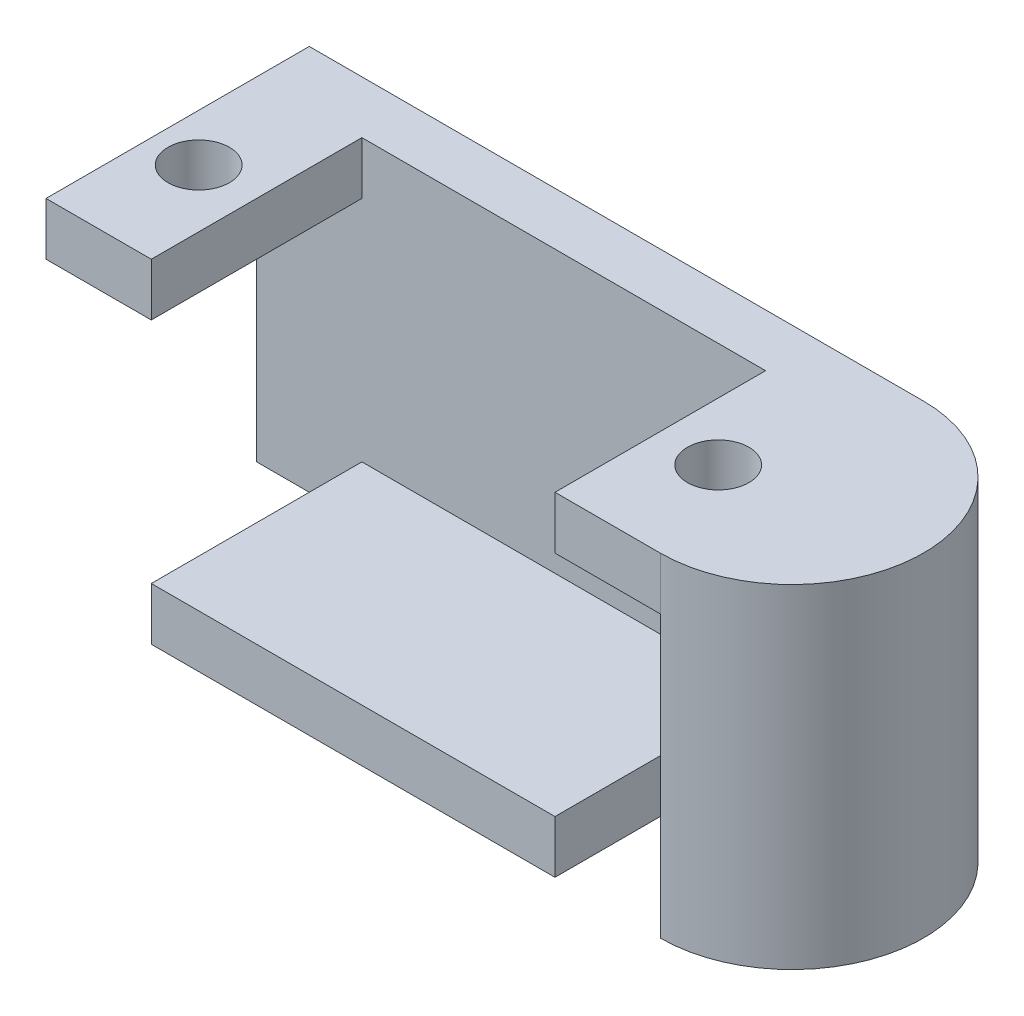
ISO-10303-21;
HEADER;
FILE_DESCRIPTION(('STEP AP214'),'2;1');
FILE_NAME('part.step','',(''),(''),'','','');
FILE_SCHEMA(('AUTOMOTIVE_DESIGN { 1 0 10303 214 1 1 1 1 }'));
ENDSEC;
DATA;
#1=APPLICATION_CONTEXT('core data for automotive mechanical design processes');
#2=APPLICATION_PROTOCOL_DEFINITION('international standard','automotive_design',2000,#1);
#3=PRODUCT_CONTEXT('',#1,'mechanical');
#4=PRODUCT('Part','Part','',(#3));
#5=PRODUCT_RELATED_PRODUCT_CATEGORY('part','',(#4));
#6=PRODUCT_DEFINITION_FORMATION('','',#4);
#7=PRODUCT_DEFINITION_CONTEXT('part definition',#1,'design');
#8=PRODUCT_DEFINITION('design','',#6,#7);
#9=PRODUCT_DEFINITION_SHAPE('','',#8);
#10=(LENGTH_UNIT() NAMED_UNIT(*) SI_UNIT(.MILLI.,.METRE.));
#11=(NAMED_UNIT(*) PLANE_ANGLE_UNIT() SI_UNIT($,.RADIAN.));
#12=(NAMED_UNIT(*) SI_UNIT($,.STERADIAN.) SOLID_ANGLE_UNIT());
#13=UNCERTAINTY_MEASURE_WITH_UNIT(LENGTH_MEASURE(1.E-05),#10,'distance_accuracy_value','');
#14=(GEOMETRIC_REPRESENTATION_CONTEXT(3) GLOBAL_UNCERTAINTY_ASSIGNED_CONTEXT((#13)) GLOBAL_UNIT_ASSIGNED_CONTEXT((#10,
#11,#12)) REPRESENTATION_CONTEXT('',''));
#15=CARTESIAN_POINT('',(0.,0.,0.));
#16=DIRECTION('',(0.,0.,1.));
#17=DIRECTION('',(1.,0.,0.));
#18=AXIS2_PLACEMENT_3D('',#15,#16,#17);
#19=CARTESIAN_POINT('',(35.,0.,-7.5));
#20=DIRECTION('',(0.,1.,0.));
#21=DIRECTION('',(0.,0.,1.));
#22=AXIS2_PLACEMENT_3D('',#19,#20,#21);
#23=PLANE('',#22);
#24=CARTESIAN_POINT('',(35.,0.,-7.5));
#25=DIRECTION('',(0.,1.,0.));
#26=DIRECTION('',(0.,0.,1.));
#27=AXIS2_PLACEMENT_3D('',#24,#25,#26);
#28=CIRCLE('',#27,7.5);
#29=CARTESIAN_POINT('',(35.,0.,0.));
#30=VERTEX_POINT('',#29);
#31=CARTESIAN_POINT('',(35.,0.,-15.));
#32=VERTEX_POINT('',#31);
#33=EDGE_CURVE('E252',#30,#32,#28,.T.);
#34=ORIENTED_EDGE('',*,*,#33,.F.);
#35=DIRECTION('',(0.,0.,1.));
#36=VECTOR('',#35,1.);
#37=CARTESIAN_POINT('',(35.,0.,-12.));
#38=LINE('',#37,#36);
#39=CARTESIAN_POINT('',(35.,0.,-12.));
#40=VERTEX_POINT('',#39);
#41=EDGE_CURVE('E227',#40,#30,#38,.T.);
#42=ORIENTED_EDGE('',*,*,#41,.F.);
#43=DIRECTION('',(1.,0.,0.));
#44=VECTOR('',#43,1.);
#45=CARTESIAN_POINT('',(35.,0.,-12.));
#46=LINE('',#45,#44);
#47=CARTESIAN_POINT('',(29.,0.,-12.));
#48=VERTEX_POINT('',#47);
#49=EDGE_CURVE('E189',#48,#40,#46,.T.);
#50=ORIENTED_EDGE('',*,*,#49,.F.);
#51=DIRECTION('',(0.,0.,1.));
#52=VECTOR('',#51,1.);
#53=CARTESIAN_POINT('',(29.,0.,-12.));
#54=LINE('',#53,#52);
#55=CARTESIAN_POINT('',(29.,0.,0.));
#56=VERTEX_POINT('',#55);
#57=EDGE_CURVE('E229',#48,#56,#54,.T.);
#58=ORIENTED_EDGE('',*,*,#57,.T.);
#59=DIRECTION('',(1.,0.,0.));
#60=VECTOR('',#59,1.);
#61=CARTESIAN_POINT('',(0.,0.,0.));
#62=LINE('',#61,#60);
#63=CARTESIAN_POINT('',(6.,0.,0.));
#64=VERTEX_POINT('',#63);
#65=EDGE_CURVE('E249',#64,#56,#62,.T.);
#66=ORIENTED_EDGE('',*,*,#65,.F.);
#67=DIRECTION('',(0.,0.,1.));
#68=VECTOR('',#67,1.);
#69=CARTESIAN_POINT('',(6.,0.,-12.));
#70=LINE('',#69,#68);
#71=CARTESIAN_POINT('',(6.,0.,-12.));
#72=VERTEX_POINT('',#71);
#73=EDGE_CURVE('E236',#72,#64,#70,.T.);
#74=ORIENTED_EDGE('',*,*,#73,.F.);
#75=DIRECTION('',(1.,0.,0.));
#76=VECTOR('',#75,1.);
#77=CARTESIAN_POINT('',(6.,0.,-12.));
#78=LINE('',#77,#76);
#79=CARTESIAN_POINT('',(0.,0.,-12.));
#80=VERTEX_POINT('',#79);
#81=EDGE_CURVE('E178',#80,#72,#78,.T.);
#82=ORIENTED_EDGE('',*,*,#81,.F.);
#83=DIRECTION('',(0.,0.,1.));
#84=VECTOR('',#83,1.);
#85=CARTESIAN_POINT('',(0.,0.,0.));
#86=LINE('',#85,#84);
#87=CARTESIAN_POINT('',(0.,0.,-15.));
#88=VERTEX_POINT('',#87);
#89=EDGE_CURVE('E219',#88,#80,#86,.T.);
#90=ORIENTED_EDGE('',*,*,#89,.F.);
#91=DIRECTION('',(-1.,0.,0.));
#92=VECTOR('',#91,1.);
#93=CARTESIAN_POINT('',(0.,0.,-15.));
#94=LINE('',#93,#92);
#95=EDGE_CURVE('E72',#32,#88,#94,.T.);
#96=ORIENTED_EDGE('',*,*,#95,.F.);
#97=EDGE_LOOP('',(#34,#42,#50,#58,#66,#74,#82,#90,#96));
#98=FACE_BOUND('',#97,.T.);
#99=CARTESIAN_POINT('',(12.,0.,-6.));
#100=DIRECTION('',(0.,1.,0.));
#101=DIRECTION('',(0.,0.,1.));
#102=AXIS2_PLACEMENT_3D('',#99,#100,#101);
#103=CIRCLE('',#102,1.25);
#104=CARTESIAN_POINT('',(12.,0.,-4.75));
#105=VERTEX_POINT('',#104);
#106=EDGE_CURVE('E11',#105,#105,#103,.F.);
#107=ORIENTED_EDGE('',*,*,#106,.F.);
#108=EDGE_LOOP('',(#107));
#109=FACE_BOUND('',#108,.T.);
#110=ADVANCED_FACE('F33',(#98,#109),#23,.F.);
#111=CARTESIAN_POINT('',(0.,19.,0.));
#112=DIRECTION('',(0.,0.,-1.));
#113=DIRECTION('',(-1.,0.,0.));
#114=AXIS2_PLACEMENT_3D('',#111,#112,#113);
#115=PLANE('',#114);
#116=DIRECTION('',(1.,0.,0.));
#117=VECTOR('',#116,1.);
#118=CARTESIAN_POINT('',(0.,19.,0.));
#119=LINE('',#118,#117);
#120=CARTESIAN_POINT('',(29.,19.,0.));
#121=VERTEX_POINT('',#120);
#122=CARTESIAN_POINT('',(35.,19.,0.));
#123=VERTEX_POINT('',#122);
#124=EDGE_CURVE('E241',#121,#123,#119,.T.);
#125=ORIENTED_EDGE('',*,*,#124,.F.);
#126=DIRECTION('',(0.,1.,0.));
#127=VECTOR('',#126,1.);
#128=CARTESIAN_POINT('',(29.,19.,0.));
#129=LINE('',#128,#127);
#130=CARTESIAN_POINT('',(29.,16.,0.));
#131=VERTEX_POINT('',#130);
#132=EDGE_CURVE('E169',#131,#121,#129,.T.);
#133=ORIENTED_EDGE('',*,*,#132,.F.);
#134=DIRECTION('',(-1.,0.,0.));
#135=VECTOR('',#134,1.);
#136=CARTESIAN_POINT('',(29.,16.,0.));
#137=LINE('',#136,#135);
#138=CARTESIAN_POINT('',(35.,16.,0.));
#139=VERTEX_POINT('',#138);
#140=EDGE_CURVE('E171',#139,#131,#137,.T.);
#141=ORIENTED_EDGE('',*,*,#140,.F.);
#142=DIRECTION('',(0.,-1.,0.));
#143=VECTOR('',#142,1.);
#144=CARTESIAN_POINT('',(35.,19.,0.));
#145=LINE('',#144,#143);
#146=EDGE_CURVE('E258',#123,#139,#145,.T.);
#147=ORIENTED_EDGE('',*,*,#146,.F.);
#148=EDGE_LOOP('',(#125,#133,#141,#147));
#149=FACE_BOUND('',#148,.T.);
#150=ADVANCED_FACE('F287',(#149),#115,.F.);
#151=ORIENTED_EDGE('',*,*,#65,.T.);
#152=DIRECTION('',(0.,-1.,0.));
#153=VECTOR('',#152,1.);
#154=CARTESIAN_POINT('',(29.,0.,0.));
#155=LINE('',#154,#153);
#156=CARTESIAN_POINT('',(29.,3.,0.));
#157=VERTEX_POINT('',#156);
#158=EDGE_CURVE('E210',#157,#56,#155,.T.);
#159=ORIENTED_EDGE('',*,*,#158,.F.);
#160=DIRECTION('',(1.,0.,0.));
#161=VECTOR('',#160,1.);
#162=CARTESIAN_POINT('',(6.,3.,0.));
#163=LINE('',#162,#161);
#164=CARTESIAN_POINT('',(6.,3.,0.));
#165=VERTEX_POINT('',#164);
#166=EDGE_CURVE('E207',#165,#157,#163,.T.);
#167=ORIENTED_EDGE('',*,*,#166,.F.);
#168=DIRECTION('',(0.,1.,0.));
#169=VECTOR('',#168,1.);
#170=CARTESIAN_POINT('',(6.,3.,0.));
#171=LINE('',#170,#169);
#172=EDGE_CURVE('E204',#64,#165,#171,.T.);
#173=ORIENTED_EDGE('',*,*,#172,.F.);
#174=EDGE_LOOP('',(#151,#159,#167,#173));
#175=FACE_BOUND('',#174,.T.);
#176=ADVANCED_FACE('F295',(#175),#115,.F.);
#177=CARTESIAN_POINT('',(0.,19.,0.));
#178=DIRECTION('',(1.,0.,0.));
#179=DIRECTION('',(0.,0.,-1.));
#180=AXIS2_PLACEMENT_3D('',#177,#178,#179);
#181=PLANE('',#180);
#182=DIRECTION('',(0.,-1.,0.));
#183=VECTOR('',#182,1.);
#184=CARTESIAN_POINT('',(0.,3.82476488460703,-12.));
#185=LINE('',#184,#183);
#186=CARTESIAN_POINT('',(0.,16.,-12.));
#187=VERTEX_POINT('',#186);
#188=EDGE_CURVE('E48',#187,#80,#185,.T.);
#189=ORIENTED_EDGE('',*,*,#188,.F.);
#190=DIRECTION('',(0.,0.,1.));
#191=VECTOR('',#190,1.);
#192=CARTESIAN_POINT('',(0.,16.,-12.));
#193=LINE('',#192,#191);
#194=CARTESIAN_POINT('',(0.,16.,0.));
#195=VERTEX_POINT('',#194);
#196=EDGE_CURVE('E158',#187,#195,#193,.T.);
#197=ORIENTED_EDGE('',*,*,#196,.T.);
#198=DIRECTION('',(0.,-1.,0.));
#199=VECTOR('',#198,1.);
#200=CARTESIAN_POINT('',(0.,19.,0.));
#201=LINE('',#200,#199);
#202=CARTESIAN_POINT('',(0.,19.,0.));
#203=VERTEX_POINT('',#202);
#204=EDGE_CURVE('E41',#203,#195,#201,.T.);
#205=ORIENTED_EDGE('',*,*,#204,.F.);
#206=DIRECTION('',(0.,0.,1.));
#207=VECTOR('',#206,1.);
#208=CARTESIAN_POINT('',(0.,19.,0.));
#209=LINE('',#208,#207);
#210=CARTESIAN_POINT('',(0.,19.,-15.));
#211=VERTEX_POINT('',#210);
#212=EDGE_CURVE('E239',#211,#203,#209,.T.);
#213=ORIENTED_EDGE('',*,*,#212,.F.);
#214=DIRECTION('',(0.,-1.,0.));
#215=VECTOR('',#214,1.);
#216=CARTESIAN_POINT('',(0.,19.,-15.));
#217=LINE('',#216,#215);
#218=EDGE_CURVE('E246',#211,#88,#217,.T.);
#219=ORIENTED_EDGE('',*,*,#218,.T.);
#220=ORIENTED_EDGE('',*,*,#89,.T.);
#221=EDGE_LOOP('',(#189,#197,#205,#213,#219,#220));
#222=FACE_BOUND('',#221,.T.);
#223=ADVANCED_FACE('F35',(#222),#181,.F.);
#224=DIRECTION('',(-1.,0.,0.));
#225=VECTOR('',#224,1.);
#226=CARTESIAN_POINT('',(6.,16.,0.));
#227=LINE('',#226,#225);
#228=CARTESIAN_POINT('',(6.,16.,0.));
#229=VERTEX_POINT('',#228);
#230=EDGE_CURVE('E201',#229,#195,#227,.T.);
#231=ORIENTED_EDGE('',*,*,#230,.F.);
#232=DIRECTION('',(0.,-1.,0.));
#233=VECTOR('',#232,1.);
#234=CARTESIAN_POINT('',(6.,19.,0.));
#235=LINE('',#234,#233);
#236=CARTESIAN_POINT('',(6.,19.,0.));
#237=VERTEX_POINT('',#236);
#238=EDGE_CURVE('E155',#237,#229,#235,.T.);
#239=ORIENTED_EDGE('',*,*,#238,.F.);
#240=EDGE_CURVE('E80',#203,#237,#119,.T.);
#241=ORIENTED_EDGE('',*,*,#240,.F.);
#242=ORIENTED_EDGE('',*,*,#204,.T.);
#243=EDGE_LOOP('',(#231,#239,#241,#242));
#244=FACE_BOUND('',#243,.T.);
#245=ADVANCED_FACE('F297',(#244),#115,.F.);
#246=CARTESIAN_POINT('',(35.,19.,-7.5));
#247=DIRECTION('',(0.,-1.,0.));
#248=DIRECTION('',(0.,0.,-1.));
#249=AXIS2_PLACEMENT_3D('',#246,#247,#248);
#250=CYLINDRICAL_SURFACE('',#249,7.5);
#251=ORIENTED_EDGE('',*,*,#33,.T.);
#252=DIRECTION('',(0.,-1.,0.));
#253=VECTOR('',#252,1.);
#254=CARTESIAN_POINT('',(35.,19.,-15.));
#255=LINE('',#254,#253);
#256=CARTESIAN_POINT('',(35.,19.,-15.));
#257=VERTEX_POINT('',#256);
#258=EDGE_CURVE('E256',#257,#32,#255,.T.);
#259=ORIENTED_EDGE('',*,*,#258,.F.);
#260=CARTESIAN_POINT('',(35.,19.,-7.5));
#261=DIRECTION('',(0.,1.,0.));
#262=DIRECTION('',(0.,0.,1.));
#263=AXIS2_PLACEMENT_3D('',#260,#261,#262);
#264=CIRCLE('',#263,7.5);
#265=EDGE_CURVE('E243',#123,#257,#264,.T.);
#266=ORIENTED_EDGE('',*,*,#265,.F.);
#267=ORIENTED_EDGE('',*,*,#146,.T.);
#268=DIRECTION('',(0.,1.,0.));
#269=VECTOR('',#268,1.);
#270=CARTESIAN_POINT('',(35.,16.,0.));
#271=LINE('',#270,#269);
#272=EDGE_CURVE('E212',#30,#139,#271,.T.);
#273=ORIENTED_EDGE('',*,*,#272,.F.);
#274=EDGE_LOOP('',(#251,#259,#266,#267,#273));
#275=FACE_BOUND('',#274,.T.);
#276=ADVANCED_FACE('F306',(#275),#250,.T.);
#277=CARTESIAN_POINT('',(0.,19.,-15.));
#278=DIRECTION('',(0.,0.,1.));
#279=DIRECTION('',(1.,0.,0.));
#280=AXIS2_PLACEMENT_3D('',#277,#278,#279);
#281=PLANE('',#280);
#282=ORIENTED_EDGE('',*,*,#95,.T.);
#283=ORIENTED_EDGE('',*,*,#218,.F.);
#284=DIRECTION('',(-1.,0.,0.));
#285=VECTOR('',#284,1.);
#286=CARTESIAN_POINT('',(0.,19.,-15.));
#287=LINE('',#286,#285);
#288=EDGE_CURVE('E57',#257,#211,#287,.T.);
#289=ORIENTED_EDGE('',*,*,#288,.F.);
#290=ORIENTED_EDGE('',*,*,#258,.T.);
#291=EDGE_LOOP('',(#282,#283,#289,#290));
#292=FACE_BOUND('',#291,.T.);
#293=ADVANCED_FACE('F303',(#292),#281,.F.);
#294=CARTESIAN_POINT('',(35.,19.,-7.5));
#295=DIRECTION('',(0.,1.,0.));
#296=DIRECTION('',(0.,0.,1.));
#297=AXIS2_PLACEMENT_3D('',#294,#295,#296);
#298=PLANE('',#297);
#299=CARTESIAN_POINT('',(32.3,19.,-6.));
#300=DIRECTION('',(0.,1.,0.));
#301=DIRECTION('',(0.,0.,1.));
#302=AXIS2_PLACEMENT_3D('',#299,#300,#301);
#303=CIRCLE('',#302,1.75);
#304=CARTESIAN_POINT('',(32.3,19.,-4.25));
#305=VERTEX_POINT('',#304);
#306=EDGE_CURVE('E265',#305,#305,#303,.T.);
#307=ORIENTED_EDGE('',*,*,#306,.F.);
#308=EDGE_LOOP('',(#307));
#309=FACE_BOUND('',#308,.T.);
#310=CARTESIAN_POINT('',(2.7,19.,-6.));
#311=DIRECTION('',(0.,1.,0.));
#312=DIRECTION('',(0.,0.,1.));
#313=AXIS2_PLACEMENT_3D('',#310,#311,#312);
#314=CIRCLE('',#313,1.75);
#315=CARTESIAN_POINT('',(2.7,19.,-4.25));
#316=VERTEX_POINT('',#315);
#317=EDGE_CURVE('E174',#316,#316,#314,.T.);
#318=ORIENTED_EDGE('',*,*,#317,.F.);
#319=EDGE_LOOP('',(#318));
#320=FACE_BOUND('',#319,.T.);
#321=DIRECTION('',(0.,0.,1.));
#322=VECTOR('',#321,1.);
#323=CARTESIAN_POINT('',(6.,19.,-12.));
#324=LINE('',#323,#322);
#325=CARTESIAN_POINT('',(6.,19.,-12.));
#326=VERTEX_POINT('',#325);
#327=EDGE_CURVE('E217',#326,#237,#324,.T.);
#328=ORIENTED_EDGE('',*,*,#327,.F.);
#329=DIRECTION('',(-1.,0.,0.));
#330=VECTOR('',#329,1.);
#331=CARTESIAN_POINT('',(6.,19.,-12.));
#332=LINE('',#331,#330);
#333=CARTESIAN_POINT('',(29.,19.,-12.));
#334=VERTEX_POINT('',#333);
#335=EDGE_CURVE('E159',#334,#326,#332,.T.);
#336=ORIENTED_EDGE('',*,*,#335,.F.);
#337=DIRECTION('',(0.,0.,1.));
#338=VECTOR('',#337,1.);
#339=CARTESIAN_POINT('',(29.,19.,-12.));
#340=LINE('',#339,#338);
#341=EDGE_CURVE('E220',#334,#121,#340,.T.);
#342=ORIENTED_EDGE('',*,*,#341,.T.);
#343=ORIENTED_EDGE('',*,*,#124,.T.);
#344=ORIENTED_EDGE('',*,*,#265,.T.);
#345=ORIENTED_EDGE('',*,*,#288,.T.);
#346=ORIENTED_EDGE('',*,*,#212,.T.);
#347=ORIENTED_EDGE('',*,*,#240,.T.);
#348=EDGE_LOOP('',(#328,#336,#342,#343,#344,#345,#346,#347));
#349=FACE_BOUND('',#348,.T.);
#350=ADVANCED_FACE('F301',(#309,#320,#349),#298,.T.);
#351=CARTESIAN_POINT('',(6.,19.,-12.));
#352=DIRECTION('',(-1.,0.,0.));
#353=DIRECTION('',(0.,0.,1.));
#354=AXIS2_PLACEMENT_3D('',#351,#352,#353);
#355=PLANE('',#354);
#356=ORIENTED_EDGE('',*,*,#238,.T.);
#357=DIRECTION('',(0.,0.,1.));
#358=VECTOR('',#357,1.);
#359=CARTESIAN_POINT('',(6.,16.,-12.));
#360=LINE('',#359,#358);
#361=CARTESIAN_POINT('',(6.,16.,-12.));
#362=VERTEX_POINT('',#361);
#363=EDGE_CURVE('E149',#362,#229,#360,.T.);
#364=ORIENTED_EDGE('',*,*,#363,.F.);
#365=DIRECTION('',(0.,-1.,0.));
#366=VECTOR('',#365,1.);
#367=CARTESIAN_POINT('',(6.,19.,-12.));
#368=LINE('',#367,#366);
#369=EDGE_CURVE('E153',#326,#362,#368,.T.);
#370=ORIENTED_EDGE('',*,*,#369,.F.);
#371=ORIENTED_EDGE('',*,*,#327,.T.);
#372=EDGE_LOOP('',(#356,#364,#370,#371));
#373=FACE_BOUND('',#372,.T.);
#374=ADVANCED_FACE('F151',(#373),#355,.F.);
#375=CARTESIAN_POINT('',(29.,19.,-12.));
#376=DIRECTION('',(1.,0.,0.));
#377=DIRECTION('',(0.,0.,-1.));
#378=AXIS2_PLACEMENT_3D('',#375,#376,#377);
#379=PLANE('',#378);
#380=ORIENTED_EDGE('',*,*,#132,.T.);
#381=ORIENTED_EDGE('',*,*,#341,.F.);
#382=DIRECTION('',(0.,1.,0.));
#383=VECTOR('',#382,1.);
#384=CARTESIAN_POINT('',(29.,19.,-12.));
#385=LINE('',#384,#383);
#386=CARTESIAN_POINT('',(29.,16.,-12.));
#387=VERTEX_POINT('',#386);
#388=EDGE_CURVE('E197',#387,#334,#385,.T.);
#389=ORIENTED_EDGE('',*,*,#388,.F.);
#390=DIRECTION('',(0.,0.,1.));
#391=VECTOR('',#390,1.);
#392=CARTESIAN_POINT('',(29.,16.,-12.));
#393=LINE('',#392,#391);
#394=EDGE_CURVE('E223',#387,#131,#393,.T.);
#395=ORIENTED_EDGE('',*,*,#394,.T.);
#396=EDGE_LOOP('',(#380,#381,#389,#395));
#397=FACE_BOUND('',#396,.T.);
#398=ADVANCED_FACE('F351',(#397),#379,.F.);
#399=CARTESIAN_POINT('',(29.,16.,-12.));
#400=DIRECTION('',(0.,1.,0.));
#401=DIRECTION('',(0.,0.,1.));
#402=AXIS2_PLACEMENT_3D('',#399,#400,#401);
#403=PLANE('',#402);
#404=CARTESIAN_POINT('',(32.3,16.,-6.));
#405=DIRECTION('',(0.,1.,0.));
#406=DIRECTION('',(0.,0.,1.));
#407=AXIS2_PLACEMENT_3D('',#404,#405,#406);
#408=CIRCLE('',#407,1.75);
#409=CARTESIAN_POINT('',(32.3,16.,-4.25));
#410=VERTEX_POINT('',#409);
#411=EDGE_CURVE('E263',#410,#410,#408,.T.);
#412=ORIENTED_EDGE('',*,*,#411,.T.);
#413=EDGE_LOOP('',(#412));
#414=FACE_BOUND('',#413,.T.);
#415=ORIENTED_EDGE('',*,*,#140,.T.);
#416=ORIENTED_EDGE('',*,*,#394,.F.);
#417=DIRECTION('',(-1.,0.,0.));
#418=VECTOR('',#417,1.);
#419=CARTESIAN_POINT('',(29.,16.,-12.));
#420=LINE('',#419,#418);
#421=CARTESIAN_POINT('',(35.,16.,-12.));
#422=VERTEX_POINT('',#421);
#423=EDGE_CURVE('E194',#422,#387,#420,.T.);
#424=ORIENTED_EDGE('',*,*,#423,.F.);
#425=DIRECTION('',(0.,0.,1.));
#426=VECTOR('',#425,1.);
#427=CARTESIAN_POINT('',(35.,16.,-12.));
#428=LINE('',#427,#426);
#429=EDGE_CURVE('E225',#422,#139,#428,.T.);
#430=ORIENTED_EDGE('',*,*,#429,.T.);
#431=EDGE_LOOP('',(#415,#416,#424,#430));
#432=FACE_BOUND('',#431,.T.);
#433=ADVANCED_FACE('F348',(#414,#432),#403,.F.);
#434=CARTESIAN_POINT('',(35.,16.,-12.));
#435=DIRECTION('',(1.,0.,0.));
#436=DIRECTION('',(0.,0.,-1.));
#437=AXIS2_PLACEMENT_3D('',#434,#435,#436);
#438=PLANE('',#437);
#439=ORIENTED_EDGE('',*,*,#272,.T.);
#440=ORIENTED_EDGE('',*,*,#429,.F.);
#441=DIRECTION('',(0.,1.,0.));
#442=VECTOR('',#441,1.);
#443=CARTESIAN_POINT('',(35.,3.14477901188326,-12.));
#444=LINE('',#443,#442);
#445=EDGE_CURVE('E192',#40,#422,#444,.T.);
#446=ORIENTED_EDGE('',*,*,#445,.F.);
#447=ORIENTED_EDGE('',*,*,#41,.T.);
#448=EDGE_LOOP('',(#439,#440,#446,#447));
#449=FACE_BOUND('',#448,.T.);
#450=ADVANCED_FACE('F343',(#449),#438,.F.);
#451=CARTESIAN_POINT('',(29.,0.,-12.));
#452=DIRECTION('',(-1.,0.,0.));
#453=DIRECTION('',(0.,0.,1.));
#454=AXIS2_PLACEMENT_3D('',#451,#452,#453);
#455=PLANE('',#454);
#456=ORIENTED_EDGE('',*,*,#158,.T.);
#457=ORIENTED_EDGE('',*,*,#57,.F.);
#458=DIRECTION('',(0.,-1.,0.));
#459=VECTOR('',#458,1.);
#460=CARTESIAN_POINT('',(29.,0.,-12.));
#461=LINE('',#460,#459);
#462=CARTESIAN_POINT('',(29.,3.,-12.));
#463=VERTEX_POINT('',#462);
#464=EDGE_CURVE('E186',#463,#48,#461,.T.);
#465=ORIENTED_EDGE('',*,*,#464,.F.);
#466=DIRECTION('',(0.,0.,1.));
#467=VECTOR('',#466,1.);
#468=CARTESIAN_POINT('',(29.,3.,-12.));
#469=LINE('',#468,#467);
#470=EDGE_CURVE('E232',#463,#157,#469,.T.);
#471=ORIENTED_EDGE('',*,*,#470,.T.);
#472=EDGE_LOOP('',(#456,#457,#465,#471));
#473=FACE_BOUND('',#472,.T.);
#474=ADVANCED_FACE('F327',(#473),#455,.F.);
#475=CARTESIAN_POINT('',(6.,3.,-12.));
#476=DIRECTION('',(0.,-1.,0.));
#477=DIRECTION('',(0.,0.,-1.));
#478=AXIS2_PLACEMENT_3D('',#475,#476,#477);
#479=PLANE('',#478);
#480=ORIENTED_EDGE('',*,*,#166,.T.);
#481=ORIENTED_EDGE('',*,*,#470,.F.);
#482=DIRECTION('',(1.,0.,0.));
#483=VECTOR('',#482,1.);
#484=CARTESIAN_POINT('',(6.,3.,-12.));
#485=LINE('',#484,#483);
#486=CARTESIAN_POINT('',(6.,3.,-12.));
#487=VERTEX_POINT('',#486);
#488=EDGE_CURVE('E183',#487,#463,#485,.T.);
#489=ORIENTED_EDGE('',*,*,#488,.F.);
#490=DIRECTION('',(0.,0.,1.));
#491=VECTOR('',#490,1.);
#492=CARTESIAN_POINT('',(6.,3.,-12.));
#493=LINE('',#492,#491);
#494=EDGE_CURVE('E234',#487,#165,#493,.T.);
#495=ORIENTED_EDGE('',*,*,#494,.T.);
#496=EDGE_LOOP('',(#480,#481,#489,#495));
#497=FACE_BOUND('',#496,.T.);
#498=ADVANCED_FACE('F330',(#497),#479,.F.);
#499=CARTESIAN_POINT('',(6.,3.,-12.));
#500=DIRECTION('',(1.,0.,0.));
#501=DIRECTION('',(0.,0.,-1.));
#502=AXIS2_PLACEMENT_3D('',#499,#500,#501);
#503=PLANE('',#502);
#504=ORIENTED_EDGE('',*,*,#172,.T.);
#505=ORIENTED_EDGE('',*,*,#494,.F.);
#506=DIRECTION('',(0.,1.,0.));
#507=VECTOR('',#506,1.);
#508=CARTESIAN_POINT('',(6.,3.,-12.));
#509=LINE('',#508,#507);
#510=EDGE_CURVE('E180',#72,#487,#509,.T.);
#511=ORIENTED_EDGE('',*,*,#510,.F.);
#512=ORIENTED_EDGE('',*,*,#73,.T.);
#513=EDGE_LOOP('',(#504,#505,#511,#512));
#514=FACE_BOUND('',#513,.T.);
#515=ADVANCED_FACE('F332',(#514),#503,.F.);
#516=CARTESIAN_POINT('',(6.,16.,-12.));
#517=DIRECTION('',(0.,1.,0.));
#518=DIRECTION('',(0.,0.,1.));
#519=AXIS2_PLACEMENT_3D('',#516,#517,#518);
#520=PLANE('',#519);
#521=CARTESIAN_POINT('',(2.7,16.,-6.));
#522=DIRECTION('',(0.,1.,0.));
#523=DIRECTION('',(0.,0.,1.));
#524=AXIS2_PLACEMENT_3D('',#521,#522,#523);
#525=CIRCLE('',#524,1.75);
#526=CARTESIAN_POINT('',(2.7,16.,-4.25));
#527=VERTEX_POINT('',#526);
#528=EDGE_CURVE('E202',#527,#527,#525,.T.);
#529=ORIENTED_EDGE('',*,*,#528,.T.);
#530=EDGE_LOOP('',(#529));
#531=FACE_BOUND('',#530,.T.);
#532=ORIENTED_EDGE('',*,*,#230,.T.);
#533=ORIENTED_EDGE('',*,*,#196,.F.);
#534=DIRECTION('',(-1.,0.,0.));
#535=VECTOR('',#534,1.);
#536=CARTESIAN_POINT('',(6.,16.,-12.));
#537=LINE('',#536,#535);
#538=EDGE_CURVE('E161',#362,#187,#537,.T.);
#539=ORIENTED_EDGE('',*,*,#538,.F.);
#540=ORIENTED_EDGE('',*,*,#363,.T.);
#541=EDGE_LOOP('',(#532,#533,#539,#540));
#542=FACE_BOUND('',#541,.T.);
#543=ADVANCED_FACE('F162',(#531,#542),#520,.F.);
#544=CARTESIAN_POINT('',(0.,0.,-12.));
#545=DIRECTION('',(0.,0.,-1.));
#546=DIRECTION('',(-1.,0.,0.));
#547=AXIS2_PLACEMENT_3D('',#544,#545,#546);
#548=PLANE('',#547);
#549=ORIENTED_EDGE('',*,*,#369,.T.);
#550=ORIENTED_EDGE('',*,*,#538,.T.);
#551=ORIENTED_EDGE('',*,*,#188,.T.);
#552=ORIENTED_EDGE('',*,*,#81,.T.);
#553=ORIENTED_EDGE('',*,*,#510,.T.);
#554=ORIENTED_EDGE('',*,*,#488,.T.);
#555=ORIENTED_EDGE('',*,*,#464,.T.);
#556=ORIENTED_EDGE('',*,*,#49,.T.);
#557=ORIENTED_EDGE('',*,*,#445,.T.);
#558=ORIENTED_EDGE('',*,*,#423,.T.);
#559=ORIENTED_EDGE('',*,*,#388,.T.);
#560=ORIENTED_EDGE('',*,*,#335,.T.);
#561=EDGE_LOOP('',(#549,#550,#551,#552,#553,#554,#555,#556,#557,#558,#559,#560));
#562=FACE_BOUND('',#561,.T.);
#563=ADVANCED_FACE('F165',(#562),#548,.F.);
#564=CARTESIAN_POINT('',(2.7,7.,-6.));
#565=DIRECTION('',(0.,1.,0.));
#566=DIRECTION('',(0.,0.,1.));
#567=AXIS2_PLACEMENT_3D('',#564,#565,#566);
#568=CYLINDRICAL_SURFACE('',#567,1.75);
#569=ORIENTED_EDGE('',*,*,#317,.T.);
#570=EDGE_LOOP('',(#569));
#571=FACE_BOUND('',#570,.T.);
#572=ORIENTED_EDGE('',*,*,#528,.F.);
#573=EDGE_LOOP('',(#572));
#574=FACE_BOUND('',#573,.T.);
#575=ADVANCED_FACE('F375',(#571,#574),#568,.F.);
#576=CARTESIAN_POINT('',(32.3,7.,-6.));
#577=DIRECTION('',(0.,1.,0.));
#578=DIRECTION('',(0.,0.,1.));
#579=AXIS2_PLACEMENT_3D('',#576,#577,#578);
#580=CYLINDRICAL_SURFACE('',#579,1.75);
#581=ORIENTED_EDGE('',*,*,#306,.T.);
#582=EDGE_LOOP('',(#581));
#583=FACE_BOUND('',#582,.T.);
#584=ORIENTED_EDGE('',*,*,#411,.F.);
#585=EDGE_LOOP('',(#584));
#586=FACE_BOUND('',#585,.T.);
#587=ADVANCED_FACE('F282',(#583,#586),#580,.F.);
#588=CARTESIAN_POINT('',(12.,-3.,-6.));
#589=DIRECTION('',(0.,1.,0.));
#590=DIRECTION('',(0.,0.,1.));
#591=AXIS2_PLACEMENT_3D('',#588,#589,#590);
#592=CYLINDRICAL_SURFACE('',#591,1.25);
#593=CARTESIAN_POINT('',(12.,-3.,-6.));
#594=DIRECTION('',(0.,-1.,0.));
#595=DIRECTION('',(0.,0.,-1.));
#596=AXIS2_PLACEMENT_3D('',#593,#594,#595);
#597=CIRCLE('',#596,1.25);
#598=CARTESIAN_POINT('',(12.,-3.,-7.25));
#599=VERTEX_POINT('',#598);
#600=EDGE_CURVE('E270',#599,#599,#597,.T.);
#601=ORIENTED_EDGE('',*,*,#600,.F.);
#602=EDGE_LOOP('',(#601));
#603=FACE_BOUND('',#602,.T.);
#604=ORIENTED_EDGE('',*,*,#106,.T.);
#605=EDGE_LOOP('',(#604));
#606=FACE_BOUND('',#605,.T.);
#607=ADVANCED_FACE('F279',(#603,#606),#592,.T.);
#608=CARTESIAN_POINT('',(12.,-3.,-6.));
#609=DIRECTION('',(0.,-1.,0.));
#610=DIRECTION('',(0.,0.,-1.));
#611=AXIS2_PLACEMENT_3D('',#608,#609,#610);
#612=PLANE('',#611);
#613=ORIENTED_EDGE('',*,*,#600,.T.);
#614=EDGE_LOOP('',(#613));
#615=FACE_BOUND('',#614,.T.);
#616=ADVANCED_FACE('F277',(#615),#612,.T.);
#617=CLOSED_SHELL('',(#110,#150,#176,#223,#245,#276,#293,#350,#374,#398,#433,#450,#474,#498,
#515,#543,#563,#575,#587,#607,#616));
#618=MANIFOLD_SOLID_BREP('B2',#617);
#619=ADVANCED_BREP_SHAPE_REPRESENTATION('',(#18,#618),#14);
#620=SHAPE_DEFINITION_REPRESENTATION(#9,#619);
ENDSEC;
END-ISO-10303-21;
